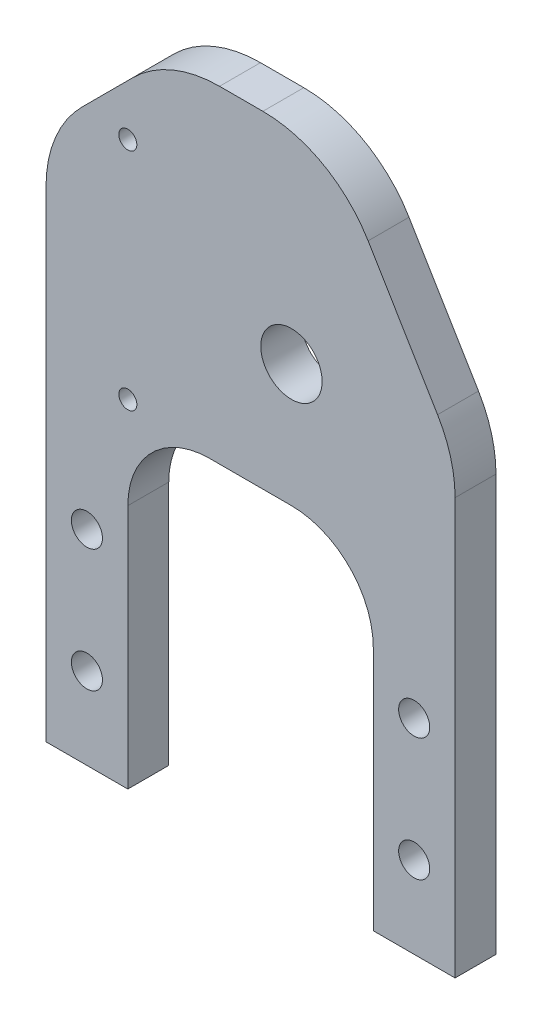
ISO-10303-21;
HEADER;
FILE_DESCRIPTION(('STEP AP214'),'2;1');
FILE_NAME('part.step','',(''),(''),'','','');
FILE_SCHEMA(('AUTOMOTIVE_DESIGN { 1 0 10303 214 1 1 1 1 }'));
ENDSEC;
DATA;
#1=APPLICATION_CONTEXT('core data for automotive mechanical design processes');
#2=APPLICATION_PROTOCOL_DEFINITION('international standard','automotive_design',2000,#1);
#3=PRODUCT_CONTEXT('',#1,'mechanical');
#4=PRODUCT('Part','Part','',(#3));
#5=PRODUCT_RELATED_PRODUCT_CATEGORY('part','',(#4));
#6=PRODUCT_DEFINITION_FORMATION('','',#4);
#7=PRODUCT_DEFINITION_CONTEXT('part definition',#1,'design');
#8=PRODUCT_DEFINITION('design','',#6,#7);
#9=PRODUCT_DEFINITION_SHAPE('','',#8);
#10=(LENGTH_UNIT() NAMED_UNIT(*) SI_UNIT(.MILLI.,.METRE.));
#11=(NAMED_UNIT(*) PLANE_ANGLE_UNIT() SI_UNIT($,.RADIAN.));
#12=(NAMED_UNIT(*) SI_UNIT($,.STERADIAN.) SOLID_ANGLE_UNIT());
#13=UNCERTAINTY_MEASURE_WITH_UNIT(LENGTH_MEASURE(1.E-05),#10,'distance_accuracy_value','');
#14=(GEOMETRIC_REPRESENTATION_CONTEXT(3) GLOBAL_UNCERTAINTY_ASSIGNED_CONTEXT((#13)) GLOBAL_UNIT_ASSIGNED_CONTEXT((#10,
#11,#12)) REPRESENTATION_CONTEXT('',''));
#15=CARTESIAN_POINT('',(0.,0.,0.));
#16=DIRECTION('',(0.,0.,1.));
#17=DIRECTION('',(1.,0.,0.));
#18=AXIS2_PLACEMENT_3D('',#15,#16,#17);
#19=CARTESIAN_POINT('',(0.,0.,6.35));
#20=DIRECTION('',(1.,0.,0.));
#21=DIRECTION('',(0.,0.,-1.));
#22=AXIS2_PLACEMENT_3D('',#19,#20,#21);
#23=PLANE('',#22);
#24=DIRECTION('',(0.,-1.,0.));
#25=VECTOR('',#24,1.);
#26=CARTESIAN_POINT('',(0.,0.,6.35));
#27=LINE('',#26,#25);
#28=CARTESIAN_POINT('',(0.,74.6592316367925,6.35));
#29=VERTEX_POINT('',#28);
#30=CARTESIAN_POINT('',(0.,0.,6.35));
#31=VERTEX_POINT('',#30);
#32=EDGE_CURVE('E149',#29,#31,#27,.T.);
#33=ORIENTED_EDGE('',*,*,#32,.F.);
#34=DIRECTION('',(0.,0.,-1.));
#35=VECTOR('',#34,1.);
#36=CARTESIAN_POINT('',(0.,74.6592316367925,6.35));
#37=LINE('',#36,#35);
#38=CARTESIAN_POINT('',(0.,74.6592316367925,0.));
#39=VERTEX_POINT('',#38);
#40=EDGE_CURVE('E199',#29,#39,#37,.T.);
#41=ORIENTED_EDGE('',*,*,#40,.T.);
#42=DIRECTION('',(0.,-1.,0.));
#43=VECTOR('',#42,1.);
#44=CARTESIAN_POINT('',(0.,0.,0.));
#45=LINE('',#44,#43);
#46=CARTESIAN_POINT('',(0.,0.,0.));
#47=VERTEX_POINT('',#46);
#48=EDGE_CURVE('E174',#39,#47,#45,.T.);
#49=ORIENTED_EDGE('',*,*,#48,.T.);
#50=DIRECTION('',(0.,0.,-1.));
#51=VECTOR('',#50,1.);
#52=CARTESIAN_POINT('',(0.,0.,6.35));
#53=LINE('',#52,#51);
#54=EDGE_CURVE('E167',#31,#47,#53,.T.);
#55=ORIENTED_EDGE('',*,*,#54,.F.);
#56=EDGE_LOOP('',(#33,#41,#49,#55));
#57=FACE_BOUND('',#56,.T.);
#58=ADVANCED_FACE('F37',(#57),#23,.F.);
#59=CARTESIAN_POINT('',(0.,0.,6.35));
#60=DIRECTION('',(0.,1.,0.));
#61=DIRECTION('',(0.,0.,1.));
#62=AXIS2_PLACEMENT_3D('',#59,#60,#61);
#63=PLANE('',#62);
#64=DIRECTION('',(1.,0.,0.));
#65=VECTOR('',#64,1.);
#66=CARTESIAN_POINT('',(0.,0.,0.));
#67=LINE('',#66,#65);
#68=CARTESIAN_POINT('',(12.7,0.,0.));
#69=VERTEX_POINT('',#68);
#70=EDGE_CURVE('E283',#47,#69,#67,.T.);
#71=ORIENTED_EDGE('',*,*,#70,.T.);
#72=DIRECTION('',(0.,0.,-1.));
#73=VECTOR('',#72,1.);
#74=CARTESIAN_POINT('',(12.7,0.,6.35));
#75=LINE('',#74,#73);
#76=CARTESIAN_POINT('',(12.7,0.,6.35));
#77=VERTEX_POINT('',#76);
#78=EDGE_CURVE('E169',#77,#69,#75,.T.);
#79=ORIENTED_EDGE('',*,*,#78,.F.);
#80=DIRECTION('',(1.,0.,0.));
#81=VECTOR('',#80,1.);
#82=CARTESIAN_POINT('',(0.,0.,6.35));
#83=LINE('',#82,#81);
#84=EDGE_CURVE('E154',#31,#77,#83,.T.);
#85=ORIENTED_EDGE('',*,*,#84,.F.);
#86=ORIENTED_EDGE('',*,*,#54,.T.);
#87=EDGE_LOOP('',(#71,#79,#85,#86));
#88=FACE_BOUND('',#87,.T.);
#89=ADVANCED_FACE('F166',(#88),#63,.F.);
#90=CARTESIAN_POINT('',(12.7,0.,6.35));
#91=DIRECTION('',(-1.,0.,0.));
#92=DIRECTION('',(0.,0.,1.));
#93=AXIS2_PLACEMENT_3D('',#90,#91,#92);
#94=PLANE('',#93);
#95=DIRECTION('',(0.,1.,0.));
#96=VECTOR('',#95,1.);
#97=CARTESIAN_POINT('',(12.7,0.,0.));
#98=LINE('',#97,#96);
#99=CARTESIAN_POINT('',(12.7,38.1,0.));
#100=VERTEX_POINT('',#99);
#101=EDGE_CURVE('E280',#69,#100,#98,.T.);
#102=ORIENTED_EDGE('',*,*,#101,.T.);
#103=DIRECTION('',(0.,0.,-1.));
#104=VECTOR('',#103,1.);
#105=CARTESIAN_POINT('',(12.7,38.1,6.35));
#106=LINE('',#105,#104);
#107=CARTESIAN_POINT('',(12.7,38.1,6.35));
#108=VERTEX_POINT('',#107);
#109=EDGE_CURVE('E189',#100,#108,#106,.F.);
#110=ORIENTED_EDGE('',*,*,#109,.T.);
#111=DIRECTION('',(0.,1.,0.));
#112=VECTOR('',#111,1.);
#113=CARTESIAN_POINT('',(12.7,0.,6.35));
#114=LINE('',#113,#112);
#115=EDGE_CURVE('E171',#77,#108,#114,.T.);
#116=ORIENTED_EDGE('',*,*,#115,.F.);
#117=ORIENTED_EDGE('',*,*,#78,.T.);
#118=EDGE_LOOP('',(#102,#110,#116,#117));
#119=FACE_BOUND('',#118,.T.);
#120=ADVANCED_FACE('F378',(#119),#94,.F.);
#121=CARTESIAN_POINT('',(12.7,50.8,6.35));
#122=DIRECTION('',(0.,1.,0.));
#123=DIRECTION('',(0.,0.,1.));
#124=AXIS2_PLACEMENT_3D('',#121,#122,#123);
#125=PLANE('',#124);
#126=DIRECTION('',(1.,0.,0.));
#127=VECTOR('',#126,1.);
#128=CARTESIAN_POINT('',(12.7,50.8,0.));
#129=LINE('',#128,#127);
#130=CARTESIAN_POINT('',(25.4,50.8,0.));
#131=VERTEX_POINT('',#130);
#132=CARTESIAN_POINT('',(38.1,50.8,0.));
#133=VERTEX_POINT('',#132);
#134=EDGE_CURVE('E275',#131,#133,#129,.T.);
#135=ORIENTED_EDGE('',*,*,#134,.T.);
#136=DIRECTION('',(0.,0.,-1.));
#137=VECTOR('',#136,1.);
#138=CARTESIAN_POINT('',(38.1,50.8,6.35));
#139=LINE('',#138,#137);
#140=CARTESIAN_POINT('',(38.1,50.8,6.35));
#141=VERTEX_POINT('',#140);
#142=EDGE_CURVE('E187',#133,#141,#139,.F.);
#143=ORIENTED_EDGE('',*,*,#142,.T.);
#144=DIRECTION('',(1.,0.,0.));
#145=VECTOR('',#144,1.);
#146=CARTESIAN_POINT('',(12.7,50.8,6.35));
#147=LINE('',#146,#145);
#148=CARTESIAN_POINT('',(25.4,50.8,6.35));
#149=VERTEX_POINT('',#148);
#150=EDGE_CURVE('E293',#149,#141,#147,.T.);
#151=ORIENTED_EDGE('',*,*,#150,.F.);
#152=DIRECTION('',(0.,0.,-1.));
#153=VECTOR('',#152,1.);
#154=CARTESIAN_POINT('',(25.4,50.8,0.));
#155=LINE('',#154,#153);
#156=EDGE_CURVE('E179',#149,#131,#155,.T.);
#157=ORIENTED_EDGE('',*,*,#156,.T.);
#158=EDGE_LOOP('',(#135,#143,#151,#157));
#159=FACE_BOUND('',#158,.T.);
#160=ADVANCED_FACE('F414',(#159),#125,.F.);
#161=CARTESIAN_POINT('',(50.8,50.8,6.35));
#162=DIRECTION('',(1.,0.,0.));
#163=DIRECTION('',(0.,0.,-1.));
#164=AXIS2_PLACEMENT_3D('',#161,#162,#163);
#165=PLANE('',#164);
#166=DIRECTION('',(0.,-1.,0.));
#167=VECTOR('',#166,1.);
#168=CARTESIAN_POINT('',(50.8,50.8,6.35));
#169=LINE('',#168,#167);
#170=CARTESIAN_POINT('',(50.8,38.1,6.35));
#171=VERTEX_POINT('',#170);
#172=CARTESIAN_POINT('',(50.8,0.,6.35));
#173=VERTEX_POINT('',#172);
#174=EDGE_CURVE('E291',#171,#173,#169,.T.);
#175=ORIENTED_EDGE('',*,*,#174,.F.);
#176=DIRECTION('',(0.,0.,-1.));
#177=VECTOR('',#176,1.);
#178=CARTESIAN_POINT('',(50.8,38.1,0.));
#179=LINE('',#178,#177);
#180=CARTESIAN_POINT('',(50.8,38.1,0.));
#181=VERTEX_POINT('',#180);
#182=EDGE_CURVE('E176',#171,#181,#179,.T.);
#183=ORIENTED_EDGE('',*,*,#182,.T.);
#184=DIRECTION('',(0.,-1.,0.));
#185=VECTOR('',#184,1.);
#186=CARTESIAN_POINT('',(50.8,50.8,0.));
#187=LINE('',#186,#185);
#188=CARTESIAN_POINT('',(50.8,0.,0.));
#189=VERTEX_POINT('',#188);
#190=EDGE_CURVE('E272',#181,#189,#187,.T.);
#191=ORIENTED_EDGE('',*,*,#190,.T.);
#192=DIRECTION('',(0.,0.,-1.));
#193=VECTOR('',#192,1.);
#194=CARTESIAN_POINT('',(50.8,0.,6.35));
#195=LINE('',#194,#193);
#196=EDGE_CURVE('E181',#173,#189,#195,.T.);
#197=ORIENTED_EDGE('',*,*,#196,.F.);
#198=EDGE_LOOP('',(#175,#183,#191,#197));
#199=FACE_BOUND('',#198,.T.);
#200=ADVANCED_FACE('F410',(#199),#165,.F.);
#201=CARTESIAN_POINT('',(50.8,0.,6.35));
#202=DIRECTION('',(0.,1.,0.));
#203=DIRECTION('',(0.,0.,1.));
#204=AXIS2_PLACEMENT_3D('',#201,#202,#203);
#205=PLANE('',#204);
#206=DIRECTION('',(1.,0.,0.));
#207=VECTOR('',#206,1.);
#208=CARTESIAN_POINT('',(50.8,0.,0.));
#209=LINE('',#208,#207);
#210=CARTESIAN_POINT('',(63.5,0.,0.));
#211=VERTEX_POINT('',#210);
#212=EDGE_CURVE('E266',#189,#211,#209,.T.);
#213=ORIENTED_EDGE('',*,*,#212,.T.);
#214=DIRECTION('',(0.,0.,-1.));
#215=VECTOR('',#214,1.);
#216=CARTESIAN_POINT('',(63.5,0.,6.35));
#217=LINE('',#216,#215);
#218=CARTESIAN_POINT('',(63.5,0.,6.35));
#219=VERTEX_POINT('',#218);
#220=EDGE_CURVE('E256',#219,#211,#217,.T.);
#221=ORIENTED_EDGE('',*,*,#220,.F.);
#222=DIRECTION('',(1.,0.,0.));
#223=VECTOR('',#222,1.);
#224=CARTESIAN_POINT('',(50.8,0.,6.35));
#225=LINE('',#224,#223);
#226=EDGE_CURVE('E267',#173,#219,#225,.T.);
#227=ORIENTED_EDGE('',*,*,#226,.F.);
#228=ORIENTED_EDGE('',*,*,#196,.T.);
#229=EDGE_LOOP('',(#213,#221,#227,#228));
#230=FACE_BOUND('',#229,.T.);
#231=ADVANCED_FACE('F264',(#230),#205,.F.);
#232=CARTESIAN_POINT('',(63.5,0.,6.35));
#233=DIRECTION('',(-1.,0.,0.));
#234=DIRECTION('',(0.,0.,1.));
#235=AXIS2_PLACEMENT_3D('',#232,#233,#234);
#236=PLANE('',#235);
#237=DIRECTION('',(0.,1.,0.));
#238=VECTOR('',#237,1.);
#239=CARTESIAN_POINT('',(63.5,0.,0.));
#240=LINE('',#239,#238);
#241=CARTESIAN_POINT('',(63.5,64.5734554677323,0.));
#242=VERTEX_POINT('',#241);
#243=EDGE_CURVE('E252',#211,#242,#240,.T.);
#244=ORIENTED_EDGE('',*,*,#243,.T.);
#245=DIRECTION('',(0.,0.,-1.));
#246=VECTOR('',#245,1.);
#247=CARTESIAN_POINT('',(63.5,64.5734554677323,6.35));
#248=LINE('',#247,#246);
#249=CARTESIAN_POINT('',(63.5,64.5734554677323,6.35));
#250=VERTEX_POINT('',#249);
#251=EDGE_CURVE('E11',#242,#250,#248,.F.);
#252=ORIENTED_EDGE('',*,*,#251,.T.);
#253=DIRECTION('',(0.,1.,0.));
#254=VECTOR('',#253,1.);
#255=CARTESIAN_POINT('',(63.5,0.,6.35));
#256=LINE('',#255,#254);
#257=EDGE_CURVE('E239',#219,#250,#256,.T.);
#258=ORIENTED_EDGE('',*,*,#257,.F.);
#259=ORIENTED_EDGE('',*,*,#220,.T.);
#260=EDGE_LOOP('',(#244,#252,#258,#259));
#261=FACE_BOUND('',#260,.T.);
#262=ADVANCED_FACE('F406',(#261),#236,.F.);
#263=CARTESIAN_POINT('',(44.45,101.6,6.35));
#264=DIRECTION('',(-0.857492925712544,-0.514495755427527,0.));
#265=DIRECTION('',(0.514495755427527,-0.857492925712544,0.));
#266=AXIS2_PLACEMENT_3D('',#263,#264,#265);
#267=PLANE('',#266);
#268=DIRECTION('',(-0.514495755427527,0.857492925712544,0.));
#269=VECTOR('',#268,1.);
#270=CARTESIAN_POINT('',(44.45,101.6,0.));
#271=LINE('',#270,#269);
#272=CARTESIAN_POINT('',(60.785240234824,74.3745996086267,0.));
#273=VERTEX_POINT('',#272);
#274=CARTESIAN_POINT('',(49.9993135154634,92.3511441408944,0.));
#275=VERTEX_POINT('',#274);
#276=EDGE_CURVE('E234',#273,#275,#271,.T.);
#277=ORIENTED_EDGE('',*,*,#276,.T.);
#278=DIRECTION('',(0.,0.,-1.));
#279=VECTOR('',#278,1.);
#280=CARTESIAN_POINT('',(49.9993135154634,92.3511441408944,6.35));
#281=LINE('',#280,#279);
#282=CARTESIAN_POINT('',(49.9993135154634,92.3511441408944,6.35));
#283=VERTEX_POINT('',#282);
#284=EDGE_CURVE('E45',#275,#283,#281,.F.);
#285=ORIENTED_EDGE('',*,*,#284,.T.);
#286=DIRECTION('',(-0.514495755427527,0.857492925712544,0.));
#287=VECTOR('',#286,1.);
#288=CARTESIAN_POINT('',(44.45,101.6,6.35));
#289=LINE('',#288,#287);
#290=CARTESIAN_POINT('',(60.785240234824,74.3745996086267,6.35));
#291=VERTEX_POINT('',#290);
#292=EDGE_CURVE('E231',#291,#283,#289,.T.);
#293=ORIENTED_EDGE('',*,*,#292,.F.);
#294=DIRECTION('',(0.,0.,-1.));
#295=VECTOR('',#294,1.);
#296=CARTESIAN_POINT('',(60.785240234824,74.3745996086267,6.35));
#297=LINE('',#296,#295);
#298=EDGE_CURVE('E224',#291,#273,#297,.T.);
#299=ORIENTED_EDGE('',*,*,#298,.T.);
#300=EDGE_LOOP('',(#277,#285,#293,#299));
#301=FACE_BOUND('',#300,.T.);
#302=ADVANCED_FACE('F230',(#301),#267,.F.);
#303=CARTESIAN_POINT('',(19.05,101.6,6.35));
#304=DIRECTION('',(0.,-1.,0.));
#305=DIRECTION('',(0.,0.,-1.));
#306=AXIS2_PLACEMENT_3D('',#303,#304,#305);
#307=PLANE('',#306);
#308=DIRECTION('',(-1.,0.,0.));
#309=VECTOR('',#308,1.);
#310=CARTESIAN_POINT('',(19.05,101.6,0.));
#311=LINE('',#310,#309);
#312=CARTESIAN_POINT('',(33.6640732806394,101.6,0.));
#313=VERTEX_POINT('',#312);
#314=CARTESIAN_POINT('',(26.9407683632075,101.6,0.));
#315=VERTEX_POINT('',#314);
#316=EDGE_CURVE('E245',#313,#315,#311,.T.);
#317=ORIENTED_EDGE('',*,*,#316,.T.);
#318=DIRECTION('',(0.,0.,-1.));
#319=VECTOR('',#318,1.);
#320=CARTESIAN_POINT('',(26.9407683632075,101.6,6.35));
#321=LINE('',#320,#319);
#322=CARTESIAN_POINT('',(26.9407683632075,101.6,6.35));
#323=VERTEX_POINT('',#322);
#324=EDGE_CURVE('E52',#315,#323,#321,.F.);
#325=ORIENTED_EDGE('',*,*,#324,.T.);
#326=DIRECTION('',(-1.,0.,0.));
#327=VECTOR('',#326,1.);
#328=CARTESIAN_POINT('',(19.05,101.6,6.35));
#329=LINE('',#328,#327);
#330=CARTESIAN_POINT('',(33.6640732806394,101.6,6.35));
#331=VERTEX_POINT('',#330);
#332=EDGE_CURVE('E238',#331,#323,#329,.T.);
#333=ORIENTED_EDGE('',*,*,#332,.F.);
#334=DIRECTION('',(0.,0.,-1.));
#335=VECTOR('',#334,1.);
#336=CARTESIAN_POINT('',(33.6640732806394,101.6,6.35));
#337=LINE('',#336,#335);
#338=EDGE_CURVE('E220',#331,#313,#337,.T.);
#339=ORIENTED_EDGE('',*,*,#338,.T.);
#340=EDGE_LOOP('',(#317,#325,#333,#339));
#341=FACE_BOUND('',#340,.T.);
#342=ADVANCED_FACE('F244',(#341),#307,.F.);
#343=CARTESIAN_POINT('',(19.05,101.6,6.35));
#344=DIRECTION('',(0.707106781186547,-0.707106781186548,0.));
#345=DIRECTION('',(0.707106781186548,0.707106781186547,0.));
#346=AXIS2_PLACEMENT_3D('',#343,#344,#345);
#347=PLANE('',#346);
#348=DIRECTION('',(-0.707106781186548,-0.707106781186547,0.));
#349=VECTOR('',#348,1.);
#350=CARTESIAN_POINT('',(19.05,101.6,0.));
#351=LINE('',#350,#349);
#352=CARTESIAN_POINT('',(13.4703841816037,96.0203841816037,0.));
#353=VERTEX_POINT('',#352);
#354=CARTESIAN_POINT('',(5.57961581839627,88.1296158183963,0.));
#355=VERTEX_POINT('',#354);
#356=EDGE_CURVE('E162',#353,#355,#351,.T.);
#357=ORIENTED_EDGE('',*,*,#356,.T.);
#358=DIRECTION('',(0.,0.,-1.));
#359=VECTOR('',#358,1.);
#360=CARTESIAN_POINT('',(5.57961581839627,88.1296158183963,6.35));
#361=LINE('',#360,#359);
#362=CARTESIAN_POINT('',(5.57961581839627,88.1296158183963,6.35));
#363=VERTEX_POINT('',#362);
#364=EDGE_CURVE('E212',#355,#363,#361,.F.);
#365=ORIENTED_EDGE('',*,*,#364,.T.);
#366=DIRECTION('',(-0.707106781186548,-0.707106781186547,0.));
#367=VECTOR('',#366,1.);
#368=CARTESIAN_POINT('',(19.05,101.6,6.35));
#369=LINE('',#368,#367);
#370=CARTESIAN_POINT('',(13.4703841816037,96.0203841816037,6.35));
#371=VERTEX_POINT('',#370);
#372=EDGE_CURVE('E258',#371,#363,#369,.T.);
#373=ORIENTED_EDGE('',*,*,#372,.F.);
#374=DIRECTION('',(0.,0.,-1.));
#375=VECTOR('',#374,1.);
#376=CARTESIAN_POINT('',(13.4703841816037,96.0203841816037,6.35));
#377=LINE('',#376,#375);
#378=EDGE_CURVE('E209',#371,#353,#377,.T.);
#379=ORIENTED_EDGE('',*,*,#378,.T.);
#380=EDGE_LOOP('',(#357,#365,#373,#379));
#381=FACE_BOUND('',#380,.T.);
#382=ADVANCED_FACE('F343',(#381),#347,.F.);
#383=CARTESIAN_POINT('',(0.,0.,6.35));
#384=DIRECTION('',(0.,0.,-1.));
#385=DIRECTION('',(-1.,0.,0.));
#386=AXIS2_PLACEMENT_3D('',#383,#384,#385);
#387=PLANE('',#386);
#388=CARTESIAN_POINT('',(12.7,52.3875,6.35));
#389=DIRECTION('',(0.,0.,1.));
#390=DIRECTION('',(1.,0.,0.));
#391=AXIS2_PLACEMENT_3D('',#388,#389,#390);
#392=CIRCLE('',#391,1.39700000000001);
#393=CARTESIAN_POINT('',(14.097,52.3875,6.35));
#394=VERTEX_POINT('',#393);
#395=EDGE_CURVE('E318',#394,#394,#392,.T.);
#396=ORIENTED_EDGE('',*,*,#395,.F.);
#397=EDGE_LOOP('',(#396));
#398=FACE_BOUND('',#397,.T.);
#399=CARTESIAN_POINT('',(12.7,87.3125,6.35));
#400=DIRECTION('',(0.,0.,1.));
#401=DIRECTION('',(1.,0.,0.));
#402=AXIS2_PLACEMENT_3D('',#399,#400,#401);
#403=CIRCLE('',#402,1.39700000000001);
#404=CARTESIAN_POINT('',(14.097,87.3125,6.35));
#405=VERTEX_POINT('',#404);
#406=EDGE_CURVE('E330',#405,#405,#403,.T.);
#407=ORIENTED_EDGE('',*,*,#406,.F.);
#408=EDGE_LOOP('',(#407));
#409=FACE_BOUND('',#408,.T.);
#410=CARTESIAN_POINT('',(38.1,69.85,6.35));
#411=DIRECTION('',(0.,0.,1.));
#412=DIRECTION('',(1.,0.,0.));
#413=AXIS2_PLACEMENT_3D('',#410,#411,#412);
#414=CIRCLE('',#413,4.7625);
#415=CARTESIAN_POINT('',(42.8625,69.85,6.35));
#416=VERTEX_POINT('',#415);
#417=EDGE_CURVE('E324',#416,#416,#414,.T.);
#418=ORIENTED_EDGE('',*,*,#417,.F.);
#419=EDGE_LOOP('',(#418));
#420=FACE_BOUND('',#419,.T.);
#421=CARTESIAN_POINT('',(6.35,31.75,6.35));
#422=DIRECTION('',(0.,0.,1.));
#423=DIRECTION('',(1.,0.,0.));
#424=AXIS2_PLACEMENT_3D('',#421,#422,#423);
#425=CIRCLE('',#424,2.413);
#426=CARTESIAN_POINT('',(8.76299999999999,31.75,6.35));
#427=VERTEX_POINT('',#426);
#428=EDGE_CURVE('E300',#427,#427,#425,.T.);
#429=ORIENTED_EDGE('',*,*,#428,.F.);
#430=EDGE_LOOP('',(#429));
#431=FACE_BOUND('',#430,.T.);
#432=CARTESIAN_POINT('',(57.15,12.7,6.35));
#433=DIRECTION('',(0.,0.,1.));
#434=DIRECTION('',(1.,0.,0.));
#435=AXIS2_PLACEMENT_3D('',#432,#433,#434);
#436=CIRCLE('',#435,2.41299999999998);
#437=CARTESIAN_POINT('',(59.563,12.7,6.35));
#438=VERTEX_POINT('',#437);
#439=EDGE_CURVE('E306',#438,#438,#436,.T.);
#440=ORIENTED_EDGE('',*,*,#439,.F.);
#441=EDGE_LOOP('',(#440));
#442=FACE_BOUND('',#441,.T.);
#443=CARTESIAN_POINT('',(57.15,31.75,6.35));
#444=DIRECTION('',(0.,0.,1.));
#445=DIRECTION('',(1.,0.,0.));
#446=AXIS2_PLACEMENT_3D('',#443,#444,#445);
#447=CIRCLE('',#446,2.41299999999999);
#448=CARTESIAN_POINT('',(59.563,31.75,6.35));
#449=VERTEX_POINT('',#448);
#450=EDGE_CURVE('E307',#449,#449,#447,.T.);
#451=ORIENTED_EDGE('',*,*,#450,.F.);
#452=EDGE_LOOP('',(#451));
#453=FACE_BOUND('',#452,.T.);
#454=CARTESIAN_POINT('',(6.35,12.7,6.35));
#455=DIRECTION('',(0.,0.,1.));
#456=DIRECTION('',(1.,0.,0.));
#457=AXIS2_PLACEMENT_3D('',#454,#455,#456);
#458=CIRCLE('',#457,2.413);
#459=CARTESIAN_POINT('',(8.76299999999999,12.7,6.35));
#460=VERTEX_POINT('',#459);
#461=EDGE_CURVE('E286',#460,#460,#458,.T.);
#462=ORIENTED_EDGE('',*,*,#461,.F.);
#463=EDGE_LOOP('',(#462));
#464=FACE_BOUND('',#463,.T.);
#465=ORIENTED_EDGE('',*,*,#372,.T.);
#466=CARTESIAN_POINT('',(19.05,74.6592316367925,6.35));
#467=DIRECTION('',(0.,0.,-1.));
#468=DIRECTION('',(-1.,0.,0.));
#469=AXIS2_PLACEMENT_3D('',#466,#467,#468);
#470=CIRCLE('',#469,19.05);
#471=EDGE_CURVE('E157',#363,#29,#470,.F.);
#472=ORIENTED_EDGE('',*,*,#471,.T.);
#473=ORIENTED_EDGE('',*,*,#32,.T.);
#474=ORIENTED_EDGE('',*,*,#84,.T.);
#475=ORIENTED_EDGE('',*,*,#115,.T.);
#476=CARTESIAN_POINT('',(25.4,38.1,6.35));
#477=DIRECTION('',(0.,0.,-1.));
#478=DIRECTION('',(-1.,0.,0.));
#479=AXIS2_PLACEMENT_3D('',#476,#477,#478);
#480=CIRCLE('',#479,12.7);
#481=EDGE_CURVE('E197',#108,#149,#480,.T.);
#482=ORIENTED_EDGE('',*,*,#481,.T.);
#483=ORIENTED_EDGE('',*,*,#150,.T.);
#484=CARTESIAN_POINT('',(38.1,38.1,6.35));
#485=DIRECTION('',(0.,0.,-1.));
#486=DIRECTION('',(-1.,0.,0.));
#487=AXIS2_PLACEMENT_3D('',#484,#485,#486);
#488=CIRCLE('',#487,12.7);
#489=EDGE_CURVE('E193',#141,#171,#488,.T.);
#490=ORIENTED_EDGE('',*,*,#489,.T.);
#491=ORIENTED_EDGE('',*,*,#174,.T.);
#492=ORIENTED_EDGE('',*,*,#226,.T.);
#493=ORIENTED_EDGE('',*,*,#257,.T.);
#494=CARTESIAN_POINT('',(44.45,64.5734554677323,6.35));
#495=DIRECTION('',(0.,0.,-1.));
#496=DIRECTION('',(-1.,0.,0.));
#497=AXIS2_PLACEMENT_3D('',#494,#495,#496);
#498=CIRCLE('',#497,19.05);
#499=EDGE_CURVE('E214',#250,#291,#498,.F.);
#500=ORIENTED_EDGE('',*,*,#499,.T.);
#501=ORIENTED_EDGE('',*,*,#292,.T.);
#502=CARTESIAN_POINT('',(33.6640732806394,82.55,6.35));
#503=DIRECTION('',(0.,0.,-1.));
#504=DIRECTION('',(-1.,0.,0.));
#505=AXIS2_PLACEMENT_3D('',#502,#503,#504);
#506=CIRCLE('',#505,19.05);
#507=EDGE_CURVE('E59',#283,#331,#506,.F.);
#508=ORIENTED_EDGE('',*,*,#507,.T.);
#509=ORIENTED_EDGE('',*,*,#332,.T.);
#510=CARTESIAN_POINT('',(26.9407683632075,82.55,6.35));
#511=DIRECTION('',(0.,0.,-1.));
#512=DIRECTION('',(-1.,0.,0.));
#513=AXIS2_PLACEMENT_3D('',#510,#511,#512);
#514=CIRCLE('',#513,19.05);
#515=EDGE_CURVE('E217',#323,#371,#514,.F.);
#516=ORIENTED_EDGE('',*,*,#515,.T.);
#517=EDGE_LOOP('',(#465,#472,#473,#474,#475,#482,#483,#490,#491,#492,#493,#500,#501,#508,#509,#516));
#518=FACE_BOUND('',#517,.T.);
#519=ADVANCED_FACE('F152',(#398,#409,#420,#431,#442,#453,#464,#518),#387,.F.);
#520=CARTESIAN_POINT('',(0.,0.,0.));
#521=DIRECTION('',(0.,0.,-1.));
#522=DIRECTION('',(-1.,0.,0.));
#523=AXIS2_PLACEMENT_3D('',#520,#521,#522);
#524=PLANE('',#523);
#525=CARTESIAN_POINT('',(12.7,52.3875,0.));
#526=DIRECTION('',(0.,0.,-1.));
#527=DIRECTION('',(-1.,0.,0.));
#528=AXIS2_PLACEMENT_3D('',#525,#526,#527);
#529=CIRCLE('',#528,1.39700000000001);
#530=CARTESIAN_POINT('',(11.303,52.3875,0.));
#531=VERTEX_POINT('',#530);
#532=EDGE_CURVE('E333',#531,#531,#529,.F.);
#533=ORIENTED_EDGE('',*,*,#532,.T.);
#534=EDGE_LOOP('',(#533));
#535=FACE_BOUND('',#534,.T.);
#536=CARTESIAN_POINT('',(12.7,87.3125,0.));
#537=DIRECTION('',(0.,0.,-1.));
#538=DIRECTION('',(-1.,0.,0.));
#539=AXIS2_PLACEMENT_3D('',#536,#537,#538);
#540=CIRCLE('',#539,1.39700000000001);
#541=CARTESIAN_POINT('',(11.303,87.3125,0.));
#542=VERTEX_POINT('',#541);
#543=EDGE_CURVE('E327',#542,#542,#540,.F.);
#544=ORIENTED_EDGE('',*,*,#543,.T.);
#545=EDGE_LOOP('',(#544));
#546=FACE_BOUND('',#545,.T.);
#547=CARTESIAN_POINT('',(38.1,69.85,0.));
#548=DIRECTION('',(0.,0.,-1.));
#549=DIRECTION('',(-1.,0.,0.));
#550=AXIS2_PLACEMENT_3D('',#547,#548,#549);
#551=CIRCLE('',#550,4.7625);
#552=CARTESIAN_POINT('',(33.3375,69.85,0.));
#553=VERTEX_POINT('',#552);
#554=EDGE_CURVE('E321',#553,#553,#551,.F.);
#555=ORIENTED_EDGE('',*,*,#554,.T.);
#556=EDGE_LOOP('',(#555));
#557=FACE_BOUND('',#556,.T.);
#558=CARTESIAN_POINT('',(6.35,31.75,0.));
#559=DIRECTION('',(0.,0.,-1.));
#560=DIRECTION('',(-1.,0.,0.));
#561=AXIS2_PLACEMENT_3D('',#558,#559,#560);
#562=CIRCLE('',#561,2.413);
#563=CARTESIAN_POINT('',(3.937,31.75,0.));
#564=VERTEX_POINT('',#563);
#565=EDGE_CURVE('E310',#564,#564,#562,.F.);
#566=ORIENTED_EDGE('',*,*,#565,.T.);
#567=EDGE_LOOP('',(#566));
#568=FACE_BOUND('',#567,.T.);
#569=CARTESIAN_POINT('',(57.15,12.7,0.));
#570=DIRECTION('',(0.,0.,-1.));
#571=DIRECTION('',(-1.,0.,0.));
#572=AXIS2_PLACEMENT_3D('',#569,#570,#571);
#573=CIRCLE('',#572,2.41299999999998);
#574=CARTESIAN_POINT('',(54.737,12.7,0.));
#575=VERTEX_POINT('',#574);
#576=EDGE_CURVE('E303',#575,#575,#573,.F.);
#577=ORIENTED_EDGE('',*,*,#576,.T.);
#578=EDGE_LOOP('',(#577));
#579=FACE_BOUND('',#578,.T.);
#580=CARTESIAN_POINT('',(57.15,31.75,0.));
#581=DIRECTION('',(0.,0.,-1.));
#582=DIRECTION('',(-1.,0.,0.));
#583=AXIS2_PLACEMENT_3D('',#580,#581,#582);
#584=CIRCLE('',#583,2.41299999999999);
#585=CARTESIAN_POINT('',(54.737,31.75,0.));
#586=VERTEX_POINT('',#585);
#587=EDGE_CURVE('E315',#586,#586,#584,.F.);
#588=ORIENTED_EDGE('',*,*,#587,.T.);
#589=EDGE_LOOP('',(#588));
#590=FACE_BOUND('',#589,.T.);
#591=CARTESIAN_POINT('',(6.35,12.7,0.));
#592=DIRECTION('',(0.,0.,-1.));
#593=DIRECTION('',(-1.,0.,0.));
#594=AXIS2_PLACEMENT_3D('',#591,#592,#593);
#595=CIRCLE('',#594,2.413);
#596=CARTESIAN_POINT('',(3.937,12.7,0.));
#597=VERTEX_POINT('',#596);
#598=EDGE_CURVE('E297',#597,#597,#595,.F.);
#599=ORIENTED_EDGE('',*,*,#598,.T.);
#600=EDGE_LOOP('',(#599));
#601=FACE_BOUND('',#600,.T.);
#602=ORIENTED_EDGE('',*,*,#48,.F.);
#603=CARTESIAN_POINT('',(19.05,74.6592316367925,0.));
#604=DIRECTION('',(0.,0.,-1.));
#605=DIRECTION('',(-1.,0.,0.));
#606=AXIS2_PLACEMENT_3D('',#603,#604,#605);
#607=CIRCLE('',#606,19.05);
#608=EDGE_CURVE('E207',#39,#355,#607,.T.);
#609=ORIENTED_EDGE('',*,*,#608,.T.);
#610=ORIENTED_EDGE('',*,*,#356,.F.);
#611=CARTESIAN_POINT('',(26.9407683632075,82.55,0.));
#612=DIRECTION('',(0.,0.,-1.));
#613=DIRECTION('',(-1.,0.,0.));
#614=AXIS2_PLACEMENT_3D('',#611,#612,#613);
#615=CIRCLE('',#614,19.05);
#616=EDGE_CURVE('E205',#353,#315,#615,.T.);
#617=ORIENTED_EDGE('',*,*,#616,.T.);
#618=ORIENTED_EDGE('',*,*,#316,.F.);
#619=CARTESIAN_POINT('',(33.6640732806394,82.55,0.));
#620=DIRECTION('',(0.,0.,-1.));
#621=DIRECTION('',(-1.,0.,0.));
#622=AXIS2_PLACEMENT_3D('',#619,#620,#621);
#623=CIRCLE('',#622,19.05);
#624=EDGE_CURVE('E203',#313,#275,#623,.T.);
#625=ORIENTED_EDGE('',*,*,#624,.T.);
#626=ORIENTED_EDGE('',*,*,#276,.F.);
#627=CARTESIAN_POINT('',(44.45,64.5734554677323,0.));
#628=DIRECTION('',(0.,0.,-1.));
#629=DIRECTION('',(-1.,0.,0.));
#630=AXIS2_PLACEMENT_3D('',#627,#628,#629);
#631=CIRCLE('',#630,19.05);
#632=EDGE_CURVE('E201',#273,#242,#631,.T.);
#633=ORIENTED_EDGE('',*,*,#632,.T.);
#634=ORIENTED_EDGE('',*,*,#243,.F.);
#635=ORIENTED_EDGE('',*,*,#212,.F.);
#636=ORIENTED_EDGE('',*,*,#190,.F.);
#637=CARTESIAN_POINT('',(38.1,38.1,0.));
#638=DIRECTION('',(0.,0.,-1.));
#639=DIRECTION('',(-1.,0.,0.));
#640=AXIS2_PLACEMENT_3D('',#637,#638,#639);
#641=CIRCLE('',#640,12.7);
#642=EDGE_CURVE('E191',#181,#133,#641,.F.);
#643=ORIENTED_EDGE('',*,*,#642,.T.);
#644=ORIENTED_EDGE('',*,*,#134,.F.);
#645=CARTESIAN_POINT('',(25.4,38.1,0.));
#646=DIRECTION('',(0.,0.,-1.));
#647=DIRECTION('',(-1.,0.,0.));
#648=AXIS2_PLACEMENT_3D('',#645,#646,#647);
#649=CIRCLE('',#648,12.7);
#650=EDGE_CURVE('E195',#131,#100,#649,.F.);
#651=ORIENTED_EDGE('',*,*,#650,.T.);
#652=ORIENTED_EDGE('',*,*,#101,.F.);
#653=ORIENTED_EDGE('',*,*,#70,.F.);
#654=EDGE_LOOP('',(#602,#609,#610,#617,#618,#625,#626,#633,#634,#635,#636,#643,#644,#651,#652,#653));
#655=FACE_BOUND('',#654,.T.);
#656=ADVANCED_FACE('F247',(#535,#546,#557,#568,#579,#590,#601,#655),#524,.T.);
#657=CARTESIAN_POINT('',(6.35,12.7,-0.00100000000000013));
#658=DIRECTION('',(0.,0.,1.));
#659=DIRECTION('',(1.,0.,0.));
#660=AXIS2_PLACEMENT_3D('',#657,#658,#659);
#661=CYLINDRICAL_SURFACE('',#660,2.413);
#662=ORIENTED_EDGE('',*,*,#598,.F.);
#663=EDGE_LOOP('',(#662));
#664=FACE_BOUND('',#663,.T.);
#665=ORIENTED_EDGE('',*,*,#461,.T.);
#666=EDGE_LOOP('',(#665));
#667=FACE_BOUND('',#666,.T.);
#668=ADVANCED_FACE('F357',(#664,#667),#661,.F.);
#669=CARTESIAN_POINT('',(57.15,31.75,-0.00100000000000013));
#670=DIRECTION('',(0.,0.,1.));
#671=DIRECTION('',(1.,0.,0.));
#672=AXIS2_PLACEMENT_3D('',#669,#670,#671);
#673=CYLINDRICAL_SURFACE('',#672,2.41299999999999);
#674=ORIENTED_EDGE('',*,*,#587,.F.);
#675=EDGE_LOOP('',(#674));
#676=FACE_BOUND('',#675,.T.);
#677=ORIENTED_EDGE('',*,*,#450,.T.);
#678=EDGE_LOOP('',(#677));
#679=FACE_BOUND('',#678,.T.);
#680=ADVANCED_FACE('F359',(#676,#679),#673,.F.);
#681=CARTESIAN_POINT('',(57.15,12.7,-0.00100000000000013));
#682=DIRECTION('',(0.,0.,1.));
#683=DIRECTION('',(1.,0.,0.));
#684=AXIS2_PLACEMENT_3D('',#681,#682,#683);
#685=CYLINDRICAL_SURFACE('',#684,2.41299999999998);
#686=ORIENTED_EDGE('',*,*,#576,.F.);
#687=EDGE_LOOP('',(#686));
#688=FACE_BOUND('',#687,.T.);
#689=ORIENTED_EDGE('',*,*,#439,.T.);
#690=EDGE_LOOP('',(#689));
#691=FACE_BOUND('',#690,.T.);
#692=ADVANCED_FACE('F366',(#688,#691),#685,.F.);
#693=CARTESIAN_POINT('',(6.35,31.75,-0.00100000000000013));
#694=DIRECTION('',(0.,0.,1.));
#695=DIRECTION('',(1.,0.,0.));
#696=AXIS2_PLACEMENT_3D('',#693,#694,#695);
#697=CYLINDRICAL_SURFACE('',#696,2.413);
#698=ORIENTED_EDGE('',*,*,#565,.F.);
#699=EDGE_LOOP('',(#698));
#700=FACE_BOUND('',#699,.T.);
#701=ORIENTED_EDGE('',*,*,#428,.T.);
#702=EDGE_LOOP('',(#701));
#703=FACE_BOUND('',#702,.T.);
#704=ADVANCED_FACE('F509',(#700,#703),#697,.F.);
#705=CARTESIAN_POINT('',(38.1,69.85,-0.00100000000000013));
#706=DIRECTION('',(0.,0.,1.));
#707=DIRECTION('',(1.,0.,0.));
#708=AXIS2_PLACEMENT_3D('',#705,#706,#707);
#709=CYLINDRICAL_SURFACE('',#708,4.7625);
#710=ORIENTED_EDGE('',*,*,#554,.F.);
#711=EDGE_LOOP('',(#710));
#712=FACE_BOUND('',#711,.T.);
#713=ORIENTED_EDGE('',*,*,#417,.T.);
#714=EDGE_LOOP('',(#713));
#715=FACE_BOUND('',#714,.T.);
#716=ADVANCED_FACE('F501',(#712,#715),#709,.F.);
#717=CARTESIAN_POINT('',(12.7,87.3125,-0.00100000000000013));
#718=DIRECTION('',(0.,0.,1.));
#719=DIRECTION('',(1.,0.,0.));
#720=AXIS2_PLACEMENT_3D('',#717,#718,#719);
#721=CYLINDRICAL_SURFACE('',#720,1.39700000000001);
#722=ORIENTED_EDGE('',*,*,#543,.F.);
#723=EDGE_LOOP('',(#722));
#724=FACE_BOUND('',#723,.T.);
#725=ORIENTED_EDGE('',*,*,#406,.T.);
#726=EDGE_LOOP('',(#725));
#727=FACE_BOUND('',#726,.T.);
#728=ADVANCED_FACE('F493',(#724,#727),#721,.F.);
#729=CARTESIAN_POINT('',(12.7,52.3875,-0.00100000000000013));
#730=DIRECTION('',(0.,0.,1.));
#731=DIRECTION('',(1.,0.,0.));
#732=AXIS2_PLACEMENT_3D('',#729,#730,#731);
#733=CYLINDRICAL_SURFACE('',#732,1.39700000000001);
#734=ORIENTED_EDGE('',*,*,#532,.F.);
#735=EDGE_LOOP('',(#734));
#736=FACE_BOUND('',#735,.T.);
#737=ORIENTED_EDGE('',*,*,#395,.T.);
#738=EDGE_LOOP('',(#737));
#739=FACE_BOUND('',#738,.T.);
#740=ADVANCED_FACE('F339',(#736,#739),#733,.F.);
#741=CARTESIAN_POINT('',(38.1,38.1,6.35));
#742=DIRECTION('',(0.,0.,1.));
#743=DIRECTION('',(1.,0.,0.));
#744=AXIS2_PLACEMENT_3D('',#741,#742,#743);
#745=CYLINDRICAL_SURFACE('',#744,12.7);
#746=ORIENTED_EDGE('',*,*,#489,.F.);
#747=ORIENTED_EDGE('',*,*,#142,.F.);
#748=ORIENTED_EDGE('',*,*,#642,.F.);
#749=ORIENTED_EDGE('',*,*,#182,.F.);
#750=EDGE_LOOP('',(#746,#747,#748,#749));
#751=FACE_BOUND('',#750,.T.);
#752=ADVANCED_FACE('F382',(#751),#745,.F.);
#753=CARTESIAN_POINT('',(25.4,38.1,6.35));
#754=DIRECTION('',(0.,0.,1.));
#755=DIRECTION('',(1.,0.,0.));
#756=AXIS2_PLACEMENT_3D('',#753,#754,#755);
#757=CYLINDRICAL_SURFACE('',#756,12.7);
#758=ORIENTED_EDGE('',*,*,#481,.F.);
#759=ORIENTED_EDGE('',*,*,#109,.F.);
#760=ORIENTED_EDGE('',*,*,#650,.F.);
#761=ORIENTED_EDGE('',*,*,#156,.F.);
#762=EDGE_LOOP('',(#758,#759,#760,#761));
#763=FACE_BOUND('',#762,.T.);
#764=ADVANCED_FACE('F385',(#763),#757,.F.);
#765=CARTESIAN_POINT('',(19.05,74.6592316367925,6.35));
#766=DIRECTION('',(0.,0.,-1.));
#767=DIRECTION('',(-1.,0.,0.));
#768=AXIS2_PLACEMENT_3D('',#765,#766,#767);
#769=CYLINDRICAL_SURFACE('',#768,19.05);
#770=ORIENTED_EDGE('',*,*,#471,.F.);
#771=ORIENTED_EDGE('',*,*,#364,.F.);
#772=ORIENTED_EDGE('',*,*,#608,.F.);
#773=ORIENTED_EDGE('',*,*,#40,.F.);
#774=EDGE_LOOP('',(#770,#771,#772,#773));
#775=FACE_BOUND('',#774,.T.);
#776=ADVANCED_FACE('F389',(#775),#769,.T.);
#777=CARTESIAN_POINT('',(26.9407683632075,82.55,6.35));
#778=DIRECTION('',(0.,0.,-1.));
#779=DIRECTION('',(-1.,0.,0.));
#780=AXIS2_PLACEMENT_3D('',#777,#778,#779);
#781=CYLINDRICAL_SURFACE('',#780,19.05);
#782=ORIENTED_EDGE('',*,*,#515,.F.);
#783=ORIENTED_EDGE('',*,*,#324,.F.);
#784=ORIENTED_EDGE('',*,*,#616,.F.);
#785=ORIENTED_EDGE('',*,*,#378,.F.);
#786=EDGE_LOOP('',(#782,#783,#784,#785));
#787=FACE_BOUND('',#786,.T.);
#788=ADVANCED_FACE('F393',(#787),#781,.T.);
#789=CARTESIAN_POINT('',(33.6640732806394,82.55,6.35));
#790=DIRECTION('',(0.,0.,-1.));
#791=DIRECTION('',(-1.,0.,0.));
#792=AXIS2_PLACEMENT_3D('',#789,#790,#791);
#793=CYLINDRICAL_SURFACE('',#792,19.05);
#794=ORIENTED_EDGE('',*,*,#507,.F.);
#795=ORIENTED_EDGE('',*,*,#284,.F.);
#796=ORIENTED_EDGE('',*,*,#624,.F.);
#797=ORIENTED_EDGE('',*,*,#338,.F.);
#798=EDGE_LOOP('',(#794,#795,#796,#797));
#799=FACE_BOUND('',#798,.T.);
#800=ADVANCED_FACE('F242',(#799),#793,.T.);
#801=CARTESIAN_POINT('',(44.45,64.5734554677323,6.35));
#802=DIRECTION('',(0.,0.,-1.));
#803=DIRECTION('',(-1.,0.,0.));
#804=AXIS2_PLACEMENT_3D('',#801,#802,#803);
#805=CYLINDRICAL_SURFACE('',#804,19.05);
#806=ORIENTED_EDGE('',*,*,#499,.F.);
#807=ORIENTED_EDGE('',*,*,#251,.F.);
#808=ORIENTED_EDGE('',*,*,#632,.F.);
#809=ORIENTED_EDGE('',*,*,#298,.F.);
#810=EDGE_LOOP('',(#806,#807,#808,#809));
#811=FACE_BOUND('',#810,.T.);
#812=ADVANCED_FACE('F39',(#811),#805,.T.);
#813=CLOSED_SHELL('',(#58,#89,#120,#160,#200,#231,#262,#302,#342,#382,#519,#656,#668,#680,#692,
#704,#716,#728,#740,#752,#764,#776,#788,#800,#812));
#814=MANIFOLD_SOLID_BREP('B2',#813);
#815=ADVANCED_BREP_SHAPE_REPRESENTATION('',(#18,#814),#14);
#816=SHAPE_DEFINITION_REPRESENTATION(#9,#815);
ENDSEC;
END-ISO-10303-21;
